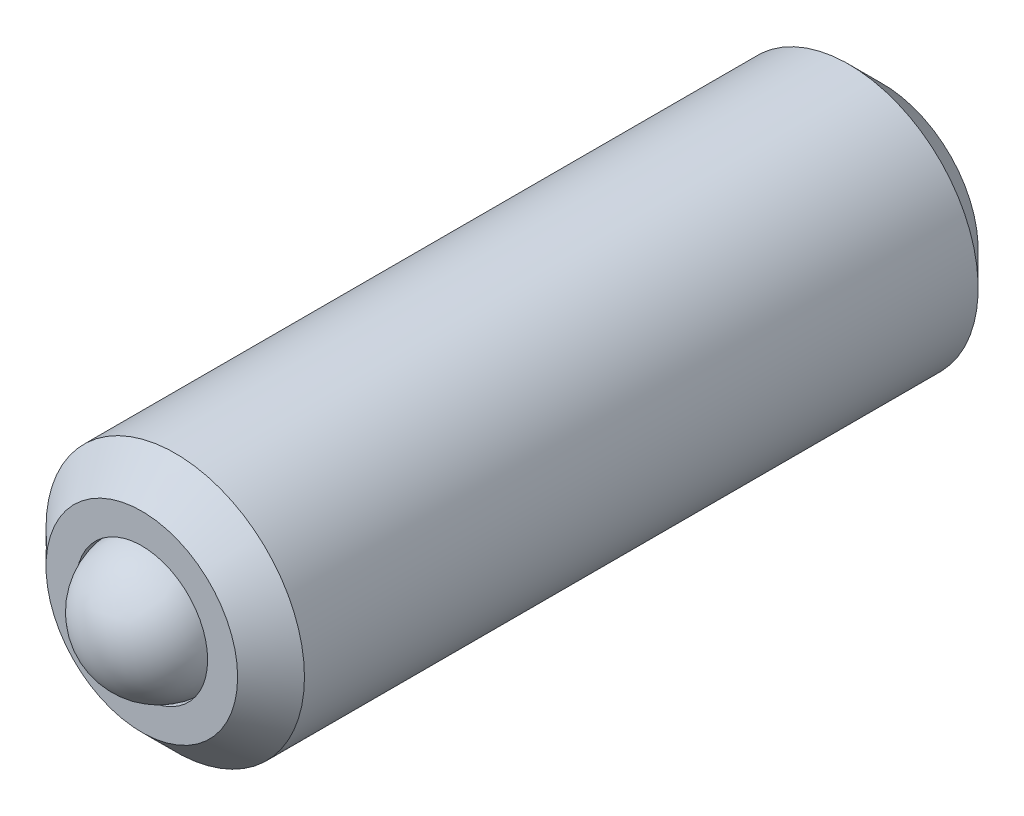
ISO-10303-21;
HEADER;
FILE_DESCRIPTION(('STEP AP214'),'2;1');
FILE_NAME('part.step','',(''),(''),'','','');
FILE_SCHEMA(('AUTOMOTIVE_DESIGN { 1 0 10303 214 1 1 1 1 }'));
ENDSEC;
DATA;
#1=APPLICATION_CONTEXT('core data for automotive mechanical design processes');
#2=APPLICATION_PROTOCOL_DEFINITION('international standard','automotive_design',2000,#1);
#3=PRODUCT_CONTEXT('',#1,'mechanical');
#4=PRODUCT('Part','Part','',(#3));
#5=PRODUCT_RELATED_PRODUCT_CATEGORY('part','',(#4));
#6=PRODUCT_DEFINITION_FORMATION('','',#4);
#7=PRODUCT_DEFINITION_CONTEXT('part definition',#1,'design');
#8=PRODUCT_DEFINITION('design','',#6,#7);
#9=PRODUCT_DEFINITION_SHAPE('','',#8);
#10=(LENGTH_UNIT() NAMED_UNIT(*) SI_UNIT(.MILLI.,.METRE.));
#11=(NAMED_UNIT(*) PLANE_ANGLE_UNIT() SI_UNIT($,.RADIAN.));
#12=(NAMED_UNIT(*) SI_UNIT($,.STERADIAN.) SOLID_ANGLE_UNIT());
#13=UNCERTAINTY_MEASURE_WITH_UNIT(LENGTH_MEASURE(1.E-05),#10,'distance_accuracy_value','');
#14=(GEOMETRIC_REPRESENTATION_CONTEXT(3) GLOBAL_UNCERTAINTY_ASSIGNED_CONTEXT((#13)) GLOBAL_UNIT_ASSIGNED_CONTEXT((#10,
#11,#12)) REPRESENTATION_CONTEXT('',''));
#15=CARTESIAN_POINT('',(0.,0.,0.));
#16=DIRECTION('',(0.,0.,1.));
#17=DIRECTION('',(1.,0.,0.));
#18=AXIS2_PLACEMENT_3D('',#15,#16,#17);
#19=CARTESIAN_POINT('',(-13.8015219006888,9.16371887558397,3.77536408732516));
#20=DIRECTION('',(-0.670867236902941,-0.151569932323345,0.725922658460052));
#21=DIRECTION('',(0.369858427725452,0.780064513114228,0.504682176047777));
#22=AXIS2_PLACEMENT_3D('',#19,#20,#21);
#23=SPHERICAL_SURFACE('',#22,0.5);
#24=CARTESIAN_POINT('',(-14.1369555191403,9.0879339094223,4.13832541655519));
#25=VERTEX_POINT('',#24);
#26=VERTEX_LOOP('',#25);
#27=FACE_BOUND('',#26,.T.);
#28=ADVANCED_FACE('P0_F11',(#27),#23,.T.);
#29=CLOSED_SHELL('',(#28));
#30=MANIFOLD_SOLID_BREP('P0_B1',#29);
#31=CARTESIAN_POINT('',(-13.8015219006888,9.16371887558398,3.90236408732514));
#32=DIRECTION('',(0.,0.,-1.));
#33=DIRECTION('',(-1.,0.,0.));
#34=AXIS2_PLACEMENT_3D('',#31,#32,#33);
#35=CYLINDRICAL_SURFACE('',#34,0.982);
#36=CARTESIAN_POINT('',(-13.8015219006888,9.16371887558398,-1.47063591267486));
#37=DIRECTION('',(0.,0.,-1.));
#38=DIRECTION('',(-1.,0.,0.));
#39=AXIS2_PLACEMENT_3D('',#36,#37,#38);
#40=CIRCLE('',#39,0.982);
#41=CARTESIAN_POINT('',(-14.7835219006888,9.16371887558398,-1.47063591267486));
#42=VERTEX_POINT('',#41);
#43=EDGE_CURVE('P1_E205',#42,#42,#40,.F.);
#44=ORIENTED_EDGE('',*,*,#43,.T.);
#45=EDGE_LOOP('',(#44));
#46=FACE_BOUND('',#45,.T.);
#47=CARTESIAN_POINT('',(-13.8015219006888,9.16371887558398,3.64836408732514));
#48=DIRECTION('',(0.,0.,1.));
#49=DIRECTION('',(1.,0.,0.));
#50=AXIS2_PLACEMENT_3D('',#47,#48,#49);
#51=CIRCLE('',#50,0.982);
#52=CARTESIAN_POINT('',(-12.8195219006888,9.16371887558398,3.64836408732514));
#53=VERTEX_POINT('',#52);
#54=EDGE_CURVE('P1_E209',#53,#53,#51,.F.);
#55=ORIENTED_EDGE('',*,*,#54,.T.);
#56=EDGE_LOOP('',(#55));
#57=FACE_BOUND('',#56,.T.);
#58=ADVANCED_FACE('P1_F15',(#46,#57),#35,.T.);
#59=CARTESIAN_POINT('',(-13.8015219006888,9.16371887558398,3.90236408732514));
#60=DIRECTION('',(0.,0.,1.));
#61=DIRECTION('',(1.,0.,0.));
#62=AXIS2_PLACEMENT_3D('',#59,#60,#61);
#63=PLANE('',#62);
#64=CARTESIAN_POINT('',(-13.8015219006888,9.16371887558398,3.90236408732514));
#65=DIRECTION('',(0.,0.,1.));
#66=DIRECTION('',(1.,0.,0.));
#67=AXIS2_PLACEMENT_3D('',#64,#65,#66);
#68=CIRCLE('',#67,0.728);
#69=CARTESIAN_POINT('',(-13.0735219006888,9.16371887558398,3.90236408732514));
#70=VERTEX_POINT('',#69);
#71=EDGE_CURVE('P1_E29',#70,#70,#68,.T.);
#72=ORIENTED_EDGE('',*,*,#71,.T.);
#73=EDGE_LOOP('',(#72));
#74=FACE_BOUND('',#73,.T.);
#75=CARTESIAN_POINT('',(-13.8015219006888,9.16371887558398,3.90236408732514));
#76=DIRECTION('',(0.,0.,1.));
#77=DIRECTION('',(1.,0.,0.));
#78=AXIS2_PLACEMENT_3D('',#75,#76,#77);
#79=CIRCLE('',#78,0.5);
#80=CARTESIAN_POINT('',(-13.3015219006888,9.16371887558398,3.90236408732514));
#81=VERTEX_POINT('',#80);
#82=EDGE_CURVE('P1_E210',#81,#81,#79,.T.);
#83=ORIENTED_EDGE('',*,*,#82,.F.);
#84=EDGE_LOOP('',(#83));
#85=FACE_BOUND('',#84,.T.);
#86=ADVANCED_FACE('P1_F181',(#74,#85),#63,.T.);
#87=CARTESIAN_POINT('',(-13.8015219006888,9.16371887558398,3.90236408732514));
#88=DIRECTION('',(0.,0.,1.));
#89=DIRECTION('',(1.,0.,0.));
#90=AXIS2_PLACEMENT_3D('',#87,#88,#89);
#91=CYLINDRICAL_SURFACE('',#90,0.5);
#92=CARTESIAN_POINT('',(-13.8015219006888,9.16371887558398,3.56825730613859));
#93=DIRECTION('',(0.,0.,1.));
#94=DIRECTION('',(1.,0.,0.));
#95=AXIS2_PLACEMENT_3D('',#92,#93,#94);
#96=CIRCLE('',#95,0.5);
#97=CARTESIAN_POINT('',(-13.3015219006888,9.16371887558398,3.56825730613859));
#98=VERTEX_POINT('',#97);
#99=EDGE_CURVE('P1_E215',#98,#98,#96,.T.);
#100=ORIENTED_EDGE('',*,*,#99,.F.);
#101=EDGE_LOOP('',(#100));
#102=FACE_BOUND('',#101,.T.);
#103=ORIENTED_EDGE('',*,*,#82,.T.);
#104=EDGE_LOOP('',(#103));
#105=FACE_BOUND('',#104,.T.);
#106=ADVANCED_FACE('P1_F187',(#102,#105),#91,.F.);
#107=CARTESIAN_POINT('',(-13.8015219006888,9.16371887558398,3.56825730613859));
#108=DIRECTION('',(0.,0.,1.));
#109=DIRECTION('',(1.,0.,0.));
#110=AXIS2_PLACEMENT_3D('',#107,#108,#109);
#111=CONICAL_SURFACE('',#110,0.5,0.785398163397443);
#112=CARTESIAN_POINT('',(-13.8015219006888,9.16371887558398,3.06825730613859));
#113=VERTEX_POINT('',#112);
#114=VERTEX_LOOP('',#113);
#115=FACE_BOUND('',#114,.T.);
#116=ORIENTED_EDGE('',*,*,#99,.T.);
#117=EDGE_LOOP('',(#116));
#118=FACE_BOUND('',#117,.T.);
#119=ADVANCED_FACE('P1_F201',(#115,#118),#111,.F.);
#120=CARTESIAN_POINT('',(-13.8015219006888,9.16371887558398,-1.72463591267486));
#121=DIRECTION('',(0.,0.,-1.));
#122=DIRECTION('',(-1.,0.,0.));
#123=AXIS2_PLACEMENT_3D('',#120,#121,#122);
#124=PLANE('',#123);
#125=CARTESIAN_POINT('',(-13.8015219006888,9.16371887558398,-1.72463591267486));
#126=DIRECTION('',(0.,0.,-1.));
#127=DIRECTION('',(-1.,0.,0.));
#128=AXIS2_PLACEMENT_3D('',#125,#126,#127);
#129=CIRCLE('',#128,0.635);
#130=CARTESIAN_POINT('',(-14.351448032092,9.48121887558398,-1.72463591267486));
#131=VERTEX_POINT('',#130);
#132=CARTESIAN_POINT('',(-13.8015219006888,9.79871887558398,-1.72463591267486));
#133=VERTEX_POINT('',#132);
#134=EDGE_CURVE('P1_E35',#131,#133,#129,.T.);
#135=ORIENTED_EDGE('',*,*,#134,.F.);
#136=CARTESIAN_POINT('',(-14.351448032092,8.84621887558398,-1.72463591267486));
#137=VERTEX_POINT('',#136);
#138=EDGE_CURVE('P1_E42',#137,#131,#129,.T.);
#139=ORIENTED_EDGE('',*,*,#138,.F.);
#140=CARTESIAN_POINT('',(-13.8015219006888,8.52871887558398,-1.72463591267486));
#141=VERTEX_POINT('',#140);
#142=EDGE_CURVE('P1_E115',#141,#137,#129,.T.);
#143=ORIENTED_EDGE('',*,*,#142,.F.);
#144=CARTESIAN_POINT('',(-13.2515957692857,8.84621887558398,-1.72463591267486));
#145=VERTEX_POINT('',#144);
#146=EDGE_CURVE('P1_E114',#145,#141,#129,.T.);
#147=ORIENTED_EDGE('',*,*,#146,.F.);
#148=CARTESIAN_POINT('',(-13.2515957692857,9.48121887558398,-1.72463591267486));
#149=VERTEX_POINT('',#148);
#150=EDGE_CURVE('P1_E85',#149,#145,#129,.T.);
#151=ORIENTED_EDGE('',*,*,#150,.F.);
#152=EDGE_CURVE('P1_E77',#133,#149,#129,.T.);
#153=ORIENTED_EDGE('',*,*,#152,.F.);
#154=EDGE_LOOP('',(#135,#139,#143,#147,#151,#153));
#155=FACE_BOUND('',#154,.T.);
#156=CARTESIAN_POINT('',(-13.8015219006888,9.16371887558398,-1.72463591267486));
#157=DIRECTION('',(0.,0.,-1.));
#158=DIRECTION('',(-1.,0.,0.));
#159=AXIS2_PLACEMENT_3D('',#156,#157,#158);
#160=CIRCLE('',#159,0.728);
#161=CARTESIAN_POINT('',(-14.5295219006888,9.16371887558398,-1.72463591267486));
#162=VERTEX_POINT('',#161);
#163=EDGE_CURVE('P1_E208',#162,#162,#160,.T.);
#164=ORIENTED_EDGE('',*,*,#163,.T.);
#165=EDGE_LOOP('',(#164));
#166=FACE_BOUND('',#165,.T.);
#167=ADVANCED_FACE('P1_F111',(#155,#166),#124,.T.);
#168=CARTESIAN_POINT('',(-13.8015219006888,9.16371887558398,-1.72463591267486));
#169=DIRECTION('',(0.,0.,1.));
#170=DIRECTION('',(1.,0.,0.));
#171=AXIS2_PLACEMENT_3D('',#168,#169,#170);
#172=CONICAL_SURFACE('',#171,0.728,0.785398163397445);
#173=ORIENTED_EDGE('',*,*,#43,.F.);
#174=EDGE_LOOP('',(#173));
#175=FACE_BOUND('',#174,.T.);
#176=ORIENTED_EDGE('',*,*,#163,.F.);
#177=EDGE_LOOP('',(#176));
#178=FACE_BOUND('',#177,.T.);
#179=ADVANCED_FACE('P1_F193',(#175,#178),#172,.T.);
#180=CARTESIAN_POINT('',(-13.8015219006888,9.16371887558398,3.90236408732514));
#181=DIRECTION('',(0.,0.,-1.));
#182=DIRECTION('',(-1.,0.,0.));
#183=AXIS2_PLACEMENT_3D('',#180,#181,#182);
#184=CONICAL_SURFACE('',#183,0.728,0.785398163397445);
#185=ORIENTED_EDGE('',*,*,#54,.F.);
#186=EDGE_LOOP('',(#185));
#187=FACE_BOUND('',#186,.T.);
#188=ORIENTED_EDGE('',*,*,#71,.F.);
#189=EDGE_LOOP('',(#188));
#190=FACE_BOUND('',#189,.T.);
#191=ADVANCED_FACE('P1_F17',(#187,#190),#184,.T.);
#192=CARTESIAN_POINT('',(-13.8015219006888,9.16371887558398,-1.72463591267486));
#193=DIRECTION('',(0.,0.,-1.));
#194=DIRECTION('',(-1.,0.,0.));
#195=AXIS2_PLACEMENT_3D('',#192,#193,#194);
#196=CONICAL_SURFACE('',#195,0.635,0.785398163397448);
#197=ORIENTED_EDGE('',*,*,#150,.T.);
#198=CARTESIAN_POINT('',(-13.2515957692857,8.53049428556369,-1.92832067550674));
#199=CARTESIAN_POINT('',(-13.2515957692857,8.56134580341744,-1.90507960896681));
#200=CARTESIAN_POINT('',(-13.2515957692857,8.59252359792126,-1.88222375636953));
#201=CARTESIAN_POINT('',(-13.2515957692857,8.65606837176296,-1.83769171355886));
#202=CARTESIAN_POINT('',(-13.2515957692857,8.68844272801976,-1.81602611118458));
#203=CARTESIAN_POINT('',(-13.2515957692857,8.75632896158876,-1.77348415360168));
#204=CARTESIAN_POINT('',(-13.2515957692857,8.79191444951981,-1.75272343402482));
#205=CARTESIAN_POINT('',(-13.2515957692857,8.86486133380717,-1.71474964501993));
#206=CARTESIAN_POINT('',(-13.2515957692857,8.90221619897699,-1.69752461573685));
#207=CARTESIAN_POINT('',(-13.2515957692857,8.95829180543014,-1.67645284792743));
#208=CARTESIAN_POINT('',(-13.2515957692857,8.97617938610514,-1.67040535114631));
#209=CARTESIAN_POINT('',(-13.2515957692857,9.01237679713688,-1.65974253899439));
#210=CARTESIAN_POINT('',(-13.2515957692857,9.03068665648945,-1.65512732228778));
#211=CARTESIAN_POINT('',(-13.2515957692857,9.08548280887646,-1.64397508728981));
#212=CARTESIAN_POINT('',(-13.2515957692857,9.12251788508019,-1.63985723572798));
#213=CARTESIAN_POINT('',(-13.2515957692857,9.19530422872083,-1.63930809595227));
#214=CARTESIAN_POINT('',(-13.2515957692857,9.23105347396853,-1.64260414174546));
#215=CARTESIAN_POINT('',(-13.2515957692857,9.28405165642866,-1.65229298252524));
#216=CARTESIAN_POINT('',(-13.2515957692857,9.30177136424451,-1.65637279027604));
#217=CARTESIAN_POINT('',(-13.2515957692857,9.33683157146912,-1.66592080719211));
#218=CARTESIAN_POINT('',(-13.2515957692857,9.35417210247592,-1.67138890018445));
#219=CARTESIAN_POINT('',(-13.2515957692857,9.40876472001817,-1.69066240023304));
#220=CARTESIAN_POINT('',(-13.2515957692857,9.44523723570716,-1.70666368801341));
#221=CARTESIAN_POINT('',(-13.2515957692857,9.51647012616568,-1.74224309375108));
#222=CARTESIAN_POINT('',(-13.2515957692857,9.55122376094072,-1.76183406231197));
#223=CARTESIAN_POINT('',(-13.2515957692857,9.61764417640121,-1.80224033739483));
#224=CARTESIAN_POINT('',(-13.2515957692857,9.64937853174813,-1.82294642547188));
#225=CARTESIAN_POINT('',(-13.2515957692857,9.71162270972014,-1.86560605496745));
#226=CARTESIAN_POINT('',(-13.2515957692857,9.74214042301385,-1.88754801254038));
#227=CARTESIAN_POINT('',(-13.2515957692857,9.77232314429079,-1.90989069375702));
#228=B_SPLINE_CURVE_WITH_KNOTS('',3,(#198,#199,#200,#201,#202,#203,#204,#205,#206,#207,#208,
#209,#210,#211,#212,#213,#214,#215,#216,#217,#218,#219,#220,#221,#222,#223,#224,#225,#226,#227),
.UNSPECIFIED.,.F.,.F.,(4,2,2,2,2,2,2,2,2,2,2,2,2,2,4),(0.,0.115919377669941,0.232742618789014,
0.356233992025996,0.479300496450954,0.535894602508555,0.592492606248892,0.70351197570278,
0.810515319981284,0.865016025394726,0.919512171643781,1.03864987361044,1.15822271572585,
1.27185363992294,1.38455547987616),.UNSPECIFIED.);
#229=EDGE_CURVE('P1_E10',#149,#145,#228,.F.);
#230=ORIENTED_EDGE('',*,*,#229,.F.);
#231=EDGE_LOOP('',(#197,#230));
#232=FACE_BOUND('',#231,.T.);
#233=ADVANCED_FACE('P1_F89',(#232),#196,.F.);
#234=ORIENTED_EDGE('',*,*,#146,.T.);
#235=CARTESIAN_POINT('',(-13.2513957692857,8.84633434563782,-1.72475141421904));
#236=CARTESIAN_POINT('',(-13.270309905032,8.83541426427321,-1.71383709331536));
#237=CARTESIAN_POINT('',(-13.2895391300036,8.82431226605955,-1.7035623497835));
#238=CARTESIAN_POINT('',(-13.3287502096868,8.80167373864922,-1.6847486979151));
#239=CARTESIAN_POINT('',(-13.3487358020015,8.79013505154644,-1.67622027049874));
#240=CARTESIAN_POINT('',(-13.3890384532812,8.76686630498107,-1.66161247496098));
#241=CARTESIAN_POINT('',(-13.4093451856095,8.75514220760494,-1.65549631440276));
#242=CARTESIAN_POINT('',(-13.450396132564,8.73144143233025,-1.64606523328979));
#243=CARTESIAN_POINT('',(-13.4711391145704,8.71946546608507,-1.64274328624867));
#244=CARTESIAN_POINT('',(-13.5218024501745,8.69021497563602,-1.63852890046083));
#245=CARTESIAN_POINT('',(-13.5518411285175,8.67287213660859,-1.63929083524874));
#246=CARTESIAN_POINT('',(-13.6112889024359,8.63854994833406,-1.64714490109844));
#247=CARTESIAN_POINT('',(-13.6406969903653,8.62157118085169,-1.65424648779059));
#248=CARTESIAN_POINT('',(-13.6923494746535,8.59174960514357,-1.67137450463772));
#249=CARTESIAN_POINT('',(-13.714831090689,8.57876983807368,-1.68050833413818));
#250=CARTESIAN_POINT('',(-13.7589132342437,8.55331900062587,-1.70108513193827));
#251=CARTESIAN_POINT('',(-13.7805163596048,8.54084643038333,-1.71252058992845));
#252=CARTESIAN_POINT('',(-13.8017219006888,8.52860340553014,-1.72475141421904));
#253=B_SPLINE_CURVE_WITH_KNOTS('',3,(#235,#236,#237,#238,#239,#240,#241,#242,#243,#244,#245,
#246,#247,#248,#249,#250,#251,#252),.UNSPECIFIED.,.F.,.F.,(4,2,2,2,2,2,2,2,4),(0.,
0.0732955286089271,0.147018835182714,0.219569654599973,0.291937483545067,0.395361253462808,
0.498939538783553,0.581380863799342,0.663557417834381),.UNSPECIFIED.);
#254=EDGE_CURVE('P1_E117',#145,#141,#253,.T.);
#255=ORIENTED_EDGE('',*,*,#254,.F.);
#256=EDGE_LOOP('',(#234,#255));
#257=FACE_BOUND('',#256,.T.);
#258=ADVANCED_FACE('P1_F278',(#257),#196,.F.);
#259=ORIENTED_EDGE('',*,*,#142,.T.);
#260=CARTESIAN_POINT('',(-13.8013219006888,8.52860340553014,-1.72475141421904));
#261=CARTESIAN_POINT('',(-13.8202360364351,8.53952348689475,-1.71383709331536));
#262=CARTESIAN_POINT('',(-13.8394652614067,8.55062548510841,-1.7035623497835));
#263=CARTESIAN_POINT('',(-13.87867634109,8.57326401251874,-1.6847486979151));
#264=CARTESIAN_POINT('',(-13.8986619334046,8.58480269962152,-1.67622027049874));
#265=CARTESIAN_POINT('',(-13.9389645846843,8.60807144618689,-1.66161247496098));
#266=CARTESIAN_POINT('',(-13.9592713170126,8.61979554356303,-1.65549631440276));
#267=CARTESIAN_POINT('',(-14.0003222639672,8.64349631883771,-1.64606523328979));
#268=CARTESIAN_POINT('',(-14.0210652459735,8.6554722850829,-1.64274328624867));
#269=CARTESIAN_POINT('',(-14.0717285815776,8.68472277553194,-1.63852890046083));
#270=CARTESIAN_POINT('',(-14.1017672599206,8.70206561455937,-1.63929083524874));
#271=CARTESIAN_POINT('',(-14.161215033839,8.7363878028339,-1.64714490109844));
#272=CARTESIAN_POINT('',(-14.1906231217684,8.75336657031628,-1.65424648779059));
#273=CARTESIAN_POINT('',(-14.2422756060566,8.7831881460244,-1.67137450463772));
#274=CARTESIAN_POINT('',(-14.2647572220921,8.79616791309428,-1.68050833413818));
#275=CARTESIAN_POINT('',(-14.3088393656469,8.82161875054209,-1.70108513193827));
#276=CARTESIAN_POINT('',(-14.3304424910079,8.83409132078463,-1.71252058992844));
#277=CARTESIAN_POINT('',(-14.351648032092,8.84633434563782,-1.72475141421904));
#278=B_SPLINE_CURVE_WITH_KNOTS('',3,(#260,#261,#262,#263,#264,#265,#266,#267,#268,#269,#270,
#271,#272,#273,#274,#275,#276,#277),.UNSPECIFIED.,.F.,.F.,(4,2,2,2,2,2,2,2,4),(0.,
0.0732955286089271,0.147018835182714,0.219569654599973,0.291937483545067,0.395361253462808,
0.498939538783554,0.581380863799342,0.663557417834381),.UNSPECIFIED.);
#279=EDGE_CURVE('P1_E125',#141,#137,#278,.T.);
#280=ORIENTED_EDGE('',*,*,#279,.F.);
#281=EDGE_LOOP('',(#259,#280));
#282=FACE_BOUND('',#281,.T.);
#283=ADVANCED_FACE('P1_F275',(#282),#196,.F.);
#284=ORIENTED_EDGE('',*,*,#138,.T.);
#285=CARTESIAN_POINT('',(-14.351448032092,8.53049428565582,-1.92832067543718));
#286=CARTESIAN_POINT('',(-14.351448032092,8.56134580350439,-1.9050796089026));
#287=CARTESIAN_POINT('',(-14.351448032092,8.59252359800301,-1.88222375631066));
#288=CARTESIAN_POINT('',(-14.351448032092,8.65606837183406,-1.83769171351068));
#289=CARTESIAN_POINT('',(-14.351448032092,8.68844272808541,-1.81602611114173));
#290=CARTESIAN_POINT('',(-14.351448032092,8.75632896164251,-1.77348415356979));
#291=CARTESIAN_POINT('',(-14.351448032092,8.7919144495671,-1.75272343399853));
#292=CARTESIAN_POINT('',(-14.351448032092,8.86486133384097,-1.71474964500401));
#293=CARTESIAN_POINT('',(-14.351448032092,8.90221619900378,-1.69752461572571));
#294=CARTESIAN_POINT('',(-14.351448032092,8.95829180545165,-1.67645284791983));
#295=CARTESIAN_POINT('',(-14.351448032092,8.97617938612887,-1.67040535113858));
#296=CARTESIAN_POINT('',(-14.351448032092,9.01237679716509,-1.65974253898683));
#297=CARTESIAN_POINT('',(-14.351448032092,9.03068665651995,-1.65512732228052));
#298=CARTESIAN_POINT('',(-14.351448032092,9.08548280891364,-1.64397508728427));
#299=CARTESIAN_POINT('',(-14.351448032092,9.12251788512181,-1.6398572357246));
#300=CARTESIAN_POINT('',(-14.351448032092,9.19530422877031,-1.63930809595486));
#301=CARTESIAN_POINT('',(-14.351448032092,9.23105347402146,-1.64260414175176));
#302=CARTESIAN_POINT('',(-14.351448032092,9.28405165648634,-1.65229298253754));
#303=CARTESIAN_POINT('',(-14.351448032092,9.30177136430376,-1.65637279029045));
#304=CARTESIAN_POINT('',(-14.351448032092,9.33683157153138,-1.66592080721078));
#305=CARTESIAN_POINT('',(-14.351448032092,9.35417210253962,-1.67138890020529));
#306=CARTESIAN_POINT('',(-14.351448032092,9.40876472009573,-1.69066240026405));
#307=CARTESIAN_POINT('',(-14.351448032092,9.44523723579647,-1.70666368805379));
#308=CARTESIAN_POINT('',(-14.351448032092,9.51647012627758,-1.74224309381122));
#309=CARTESIAN_POINT('',(-14.351448032092,9.55122376106346,-1.76183406238251));
#310=CARTESIAN_POINT('',(-14.351448032092,9.61764417654344,-1.80224033748529));
#311=CARTESIAN_POINT('',(-14.351448032092,9.64937853189908,-1.82294642557174));
#312=CARTESIAN_POINT('',(-14.351448032092,9.71162270988823,-1.86560605508606));
#313=CARTESIAN_POINT('',(-14.351448032092,9.74214042319035,-1.88754801266831));
#314=CARTESIAN_POINT('',(-14.351448032092,9.7723231444757,-1.90989069389423));
#315=B_SPLINE_CURVE_WITH_KNOTS('',3,(#285,#286,#287,#288,#289,#290,#291,#292,#293,#294,#295,
#296,#297,#298,#299,#300,#301,#302,#303,#304,#305,#306,#307,#308,#309,#310,#311,#312,#313,#314),
.UNSPECIFIED.,.F.,.F.,(4,2,2,2,2,2,2,2,2,2,2,2,2,2,4),(0.,0.115919377647874,0.232742618744465,
0.356233991956237,0.479300496356226,0.535894602420219,0.592492606166936,0.703511975633009,
0.810515319922693,0.865016025342174,0.919512171597262,1.03864987360729,1.15822271576635,
1.27185364000079,1.38455547999086),.UNSPECIFIED.);
#316=EDGE_CURVE('P1_E145',#137,#131,#315,.T.);
#317=ORIENTED_EDGE('',*,*,#316,.F.);
#318=EDGE_LOOP('',(#284,#317));
#319=FACE_BOUND('',#318,.T.);
#320=ADVANCED_FACE('P1_F277',(#319),#196,.F.);
#321=ORIENTED_EDGE('',*,*,#134,.T.);
#322=CARTESIAN_POINT('',(-14.351648032092,9.48110340553014,-1.72475141421904));
#323=CARTESIAN_POINT('',(-14.3327338963457,9.49202348689475,-1.71383709331536));
#324=CARTESIAN_POINT('',(-14.3135046713741,9.50312548510841,-1.7035623497835));
#325=CARTESIAN_POINT('',(-14.2742935916908,9.52576401251874,-1.6847486979151));
#326=CARTESIAN_POINT('',(-14.2543079993762,9.53730269962152,-1.67622027049874));
#327=CARTESIAN_POINT('',(-14.2140053480965,9.56057144618689,-1.66161247496098));
#328=CARTESIAN_POINT('',(-14.1936986157682,9.57229554356303,-1.65549631440276));
#329=CARTESIAN_POINT('',(-14.1526476688136,9.59599631883771,-1.64606523328979));
#330=CARTESIAN_POINT('',(-14.1319046868073,9.6079722850829,-1.64274328624867));
#331=CARTESIAN_POINT('',(-14.0812413512032,9.63722277553195,-1.63852890046083));
#332=CARTESIAN_POINT('',(-14.0512026728602,9.65456561455937,-1.63929083524874));
#333=CARTESIAN_POINT('',(-13.9917548989418,9.6888878028339,-1.64714490109844));
#334=CARTESIAN_POINT('',(-13.9623468110124,9.70586657031628,-1.65424648779059));
#335=CARTESIAN_POINT('',(-13.9106943267242,9.7356881460244,-1.67137450463772));
#336=CARTESIAN_POINT('',(-13.8882127106887,9.74866791309428,-1.68050833413818));
#337=CARTESIAN_POINT('',(-13.8441305671339,9.77411875054209,-1.70108513193827));
#338=CARTESIAN_POINT('',(-13.8225274417729,9.78659132078463,-1.71252058992845));
#339=CARTESIAN_POINT('',(-13.8013219006888,9.79883434563782,-1.72475141421904));
#340=B_SPLINE_CURVE_WITH_KNOTS('',3,(#322,#323,#324,#325,#326,#327,#328,#329,#330,#331,#332,
#333,#334,#335,#336,#337,#338,#339),.UNSPECIFIED.,.F.,.F.,(4,2,2,2,2,2,2,2,4),(0.,
0.073295528608927,0.147018835182714,0.219569654599973,0.291937483545065,0.395361253462808,
0.498939538783553,0.581380863799342,0.663557417834381),.UNSPECIFIED.);
#341=EDGE_CURVE('P1_E101',#131,#133,#340,.T.);
#342=ORIENTED_EDGE('',*,*,#341,.F.);
#343=EDGE_LOOP('',(#321,#342));
#344=FACE_BOUND('',#343,.T.);
#345=ADVANCED_FACE('P1_F138',(#344),#196,.F.);
#346=ORIENTED_EDGE('',*,*,#152,.T.);
#347=CARTESIAN_POINT('',(-13.8017219006888,9.79883434563782,-1.72475141421904));
#348=CARTESIAN_POINT('',(-13.7828077649426,9.78791426427321,-1.71383709331536));
#349=CARTESIAN_POINT('',(-13.763578539971,9.77681226605955,-1.7035623497835));
#350=CARTESIAN_POINT('',(-13.7243674602877,9.75417373864922,-1.6847486979151));
#351=CARTESIAN_POINT('',(-13.7043818679731,9.74263505154644,-1.67622027049874));
#352=CARTESIAN_POINT('',(-13.6640792166934,9.71936630498107,-1.66161247496098));
#353=CARTESIAN_POINT('',(-13.6437724843651,9.70764220760494,-1.65549631440276));
#354=CARTESIAN_POINT('',(-13.6027215374105,9.68394143233025,-1.64606523328979));
#355=CARTESIAN_POINT('',(-13.5819785554041,9.67196546608507,-1.64274328624867));
#356=CARTESIAN_POINT('',(-13.5313152198001,9.64271497563602,-1.63852890046083));
#357=CARTESIAN_POINT('',(-13.5012765414571,9.6253721366086,-1.63929083524874));
#358=CARTESIAN_POINT('',(-13.4418287675387,9.59104994833406,-1.64714490109844));
#359=CARTESIAN_POINT('',(-13.4124206796093,9.57407118085169,-1.65424648779059));
#360=CARTESIAN_POINT('',(-13.3607681953211,9.54424960514357,-1.67137450463772));
#361=CARTESIAN_POINT('',(-13.3382865792856,9.53126983807368,-1.68050833413818));
#362=CARTESIAN_POINT('',(-13.2942044357308,9.50581900062587,-1.70108513193827));
#363=CARTESIAN_POINT('',(-13.2726013103698,9.49334643038334,-1.71252058992845));
#364=CARTESIAN_POINT('',(-13.2513957692857,9.48110340553014,-1.72475141421904));
#365=B_SPLINE_CURVE_WITH_KNOTS('',3,(#347,#348,#349,#350,#351,#352,#353,#354,#355,#356,#357,
#358,#359,#360,#361,#362,#363,#364),.UNSPECIFIED.,.F.,.F.,(4,2,2,2,2,2,2,2,4),(0.,
0.0732955286089271,0.147018835182714,0.219569654599973,0.291937483545066,0.395361253462808,
0.498939538783553,0.581380863799342,0.663557417834381),.UNSPECIFIED.);
#366=EDGE_CURVE('P1_E81',#133,#149,#365,.T.);
#367=ORIENTED_EDGE('',*,*,#366,.F.);
#368=EDGE_LOOP('',(#346,#367));
#369=FACE_BOUND('',#368,.T.);
#370=ADVANCED_FACE('P1_F79',(#369),#196,.F.);
#371=CARTESIAN_POINT('',(-13.8015219006888,9.16371887558398,0.307364087325137));
#372=DIRECTION('',(0.,0.,1.));
#373=DIRECTION('',(1.,0.,0.));
#374=AXIS2_PLACEMENT_3D('',#371,#372,#373);
#375=PLANE('',#374);
#376=DIRECTION('',(0.866025403784439,-0.5,0.));
#377=VECTOR('',#376,1.);
#378=CARTESIAN_POINT('',(-13.2515957692857,9.48121887558398,0.307364087325137));
#379=LINE('',#378,#377);
#380=CARTESIAN_POINT('',(-13.8015219006888,9.79871887558398,0.307364087325137));
#381=VERTEX_POINT('',#380);
#382=CARTESIAN_POINT('',(-13.2515957692857,9.48121887558398,0.307364087325137));
#383=VERTEX_POINT('',#382);
#384=EDGE_CURVE('P1_E100',#381,#383,#379,.T.);
#385=ORIENTED_EDGE('',*,*,#384,.T.);
#386=DIRECTION('',(0.,-1.,0.));
#387=VECTOR('',#386,1.);
#388=CARTESIAN_POINT('',(-13.2515957692857,8.84621887558398,0.307364087325137));
#389=LINE('',#388,#387);
#390=CARTESIAN_POINT('',(-13.2515957692857,8.84621887558398,0.307364087325137));
#391=VERTEX_POINT('',#390);
#392=EDGE_CURVE('P1_E105',#383,#391,#389,.T.);
#393=ORIENTED_EDGE('',*,*,#392,.T.);
#394=DIRECTION('',(-0.866025403784439,-0.5,0.));
#395=VECTOR('',#394,1.);
#396=CARTESIAN_POINT('',(-13.8015219006888,8.52871887558398,0.307364087325137));
#397=LINE('',#396,#395);
#398=CARTESIAN_POINT('',(-13.8015219006888,8.52871887558398,0.307364087325137));
#399=VERTEX_POINT('',#398);
#400=EDGE_CURVE('P1_E247',#391,#399,#397,.T.);
#401=ORIENTED_EDGE('',*,*,#400,.T.);
#402=DIRECTION('',(-0.866025403784439,0.5,0.));
#403=VECTOR('',#402,1.);
#404=CARTESIAN_POINT('',(-14.351448032092,8.84621887558398,0.307364087325137));
#405=LINE('',#404,#403);
#406=CARTESIAN_POINT('',(-14.351448032092,8.84621887558398,0.307364087325137));
#407=VERTEX_POINT('',#406);
#408=EDGE_CURVE('P1_E251',#399,#407,#405,.T.);
#409=ORIENTED_EDGE('',*,*,#408,.T.);
#410=DIRECTION('',(0.,1.,0.));
#411=VECTOR('',#410,1.);
#412=CARTESIAN_POINT('',(-14.351448032092,9.48121887558398,0.307364087325137));
#413=LINE('',#412,#411);
#414=CARTESIAN_POINT('',(-14.351448032092,9.48121887558398,0.307364087325137));
#415=VERTEX_POINT('',#414);
#416=EDGE_CURVE('P1_E254',#407,#415,#413,.T.);
#417=ORIENTED_EDGE('',*,*,#416,.T.);
#418=DIRECTION('',(0.866025403784439,0.5,0.));
#419=VECTOR('',#418,1.);
#420=CARTESIAN_POINT('',(-13.8015219006888,9.79871887558398,0.307364087325137));
#421=LINE('',#420,#419);
#422=EDGE_CURVE('P1_E108',#415,#381,#421,.T.);
#423=ORIENTED_EDGE('',*,*,#422,.T.);
#424=EDGE_LOOP('',(#385,#393,#401,#409,#417,#423));
#425=FACE_BOUND('',#424,.T.);
#426=ADVANCED_FACE('P1_F137',(#425),#375,.F.);
#427=CARTESIAN_POINT('',(-13.2515957692857,8.84621887558398,0.307364087325137));
#428=DIRECTION('',(1.,0.,0.));
#429=DIRECTION('',(0.,1.,0.));
#430=AXIS2_PLACEMENT_3D('',#427,#428,#429);
#431=PLANE('',#430);
#432=DIRECTION('',(0.,0.,-1.));
#433=VECTOR('',#432,1.);
#434=CARTESIAN_POINT('',(-13.2515957692857,9.48121887558398,0.307364087325137));
#435=LINE('',#434,#433);
#436=EDGE_CURVE('P1_E97',#383,#149,#435,.T.);
#437=ORIENTED_EDGE('',*,*,#436,.T.);
#438=ORIENTED_EDGE('',*,*,#229,.T.);
#439=DIRECTION('',(0.,0.,-1.));
#440=VECTOR('',#439,1.);
#441=CARTESIAN_POINT('',(-13.2515957692857,8.84621887558398,0.307364087325137));
#442=LINE('',#441,#440);
#443=EDGE_CURVE('P1_E107',#391,#145,#442,.T.);
#444=ORIENTED_EDGE('',*,*,#443,.F.);
#445=ORIENTED_EDGE('',*,*,#392,.F.);
#446=EDGE_LOOP('',(#437,#438,#444,#445));
#447=FACE_BOUND('',#446,.T.);
#448=ADVANCED_FACE('P1_F103',(#447),#431,.F.);
#449=CARTESIAN_POINT('',(-13.8015219006888,8.52871887558398,0.307364087325137));
#450=DIRECTION('',(0.5,-0.866025403784439,0.));
#451=DIRECTION('',(0.866025403784439,0.5,0.));
#452=AXIS2_PLACEMENT_3D('',#449,#450,#451);
#453=PLANE('',#452);
#454=ORIENTED_EDGE('',*,*,#443,.T.);
#455=ORIENTED_EDGE('',*,*,#254,.T.);
#456=DIRECTION('',(0.,0.,-1.));
#457=VECTOR('',#456,1.);
#458=CARTESIAN_POINT('',(-13.8015219006888,8.52871887558398,0.307364087325137));
#459=LINE('',#458,#457);
#460=EDGE_CURVE('P1_E263',#399,#141,#459,.T.);
#461=ORIENTED_EDGE('',*,*,#460,.F.);
#462=ORIENTED_EDGE('',*,*,#400,.F.);
#463=EDGE_LOOP('',(#454,#455,#461,#462));
#464=FACE_BOUND('',#463,.T.);
#465=ADVANCED_FACE('P1_F132',(#464),#453,.F.);
#466=CARTESIAN_POINT('',(-14.351448032092,8.84621887558398,0.307364087325137));
#467=DIRECTION('',(-0.5,-0.866025403784439,0.));
#468=DIRECTION('',(0.866025403784439,-0.5,0.));
#469=AXIS2_PLACEMENT_3D('',#466,#467,#468);
#470=PLANE('',#469);
#471=ORIENTED_EDGE('',*,*,#460,.T.);
#472=ORIENTED_EDGE('',*,*,#279,.T.);
#473=DIRECTION('',(0.,0.,-1.));
#474=VECTOR('',#473,1.);
#475=CARTESIAN_POINT('',(-14.351448032092,8.84621887558398,0.307364087325137));
#476=LINE('',#475,#474);
#477=EDGE_CURVE('P1_E261',#407,#137,#476,.T.);
#478=ORIENTED_EDGE('',*,*,#477,.F.);
#479=ORIENTED_EDGE('',*,*,#408,.F.);
#480=EDGE_LOOP('',(#471,#472,#478,#479));
#481=FACE_BOUND('',#480,.T.);
#482=ADVANCED_FACE('P1_F169',(#481),#470,.F.);
#483=CARTESIAN_POINT('',(-14.351448032092,9.48121887558398,0.307364087325137));
#484=DIRECTION('',(-1.,0.,0.));
#485=DIRECTION('',(0.,-1.,0.));
#486=AXIS2_PLACEMENT_3D('',#483,#484,#485);
#487=PLANE('',#486);
#488=ORIENTED_EDGE('',*,*,#477,.T.);
#489=ORIENTED_EDGE('',*,*,#316,.T.);
#490=DIRECTION('',(0.,0.,-1.));
#491=VECTOR('',#490,1.);
#492=CARTESIAN_POINT('',(-14.351448032092,9.48121887558398,0.307364087325137));
#493=LINE('',#492,#491);
#494=EDGE_CURVE('P1_E258',#415,#131,#493,.T.);
#495=ORIENTED_EDGE('',*,*,#494,.F.);
#496=ORIENTED_EDGE('',*,*,#416,.F.);
#497=EDGE_LOOP('',(#488,#489,#495,#496));
#498=FACE_BOUND('',#497,.T.);
#499=ADVANCED_FACE('P1_F165',(#498),#487,.F.);
#500=CARTESIAN_POINT('',(-13.8015219006888,9.79871887558398,0.307364087325137));
#501=DIRECTION('',(-0.5,0.866025403784439,0.));
#502=DIRECTION('',(-0.866025403784439,-0.5,0.));
#503=AXIS2_PLACEMENT_3D('',#500,#501,#502);
#504=PLANE('',#503);
#505=ORIENTED_EDGE('',*,*,#494,.T.);
#506=ORIENTED_EDGE('',*,*,#341,.T.);
#507=DIRECTION('',(0.,0.,-1.));
#508=VECTOR('',#507,1.);
#509=CARTESIAN_POINT('',(-13.8015219006888,9.79871887558398,0.307364087325137));
#510=LINE('',#509,#508);
#511=EDGE_CURVE('P1_E99',#381,#133,#510,.T.);
#512=ORIENTED_EDGE('',*,*,#511,.F.);
#513=ORIENTED_EDGE('',*,*,#422,.F.);
#514=EDGE_LOOP('',(#505,#506,#512,#513));
#515=FACE_BOUND('',#514,.T.);
#516=ADVANCED_FACE('P1_F162',(#515),#504,.F.);
#517=CARTESIAN_POINT('',(-13.2515957692857,9.48121887558398,0.307364087325137));
#518=DIRECTION('',(0.5,0.866025403784439,0.));
#519=DIRECTION('',(-0.866025403784439,0.5,0.));
#520=AXIS2_PLACEMENT_3D('',#517,#518,#519);
#521=PLANE('',#520);
#522=ORIENTED_EDGE('',*,*,#511,.T.);
#523=ORIENTED_EDGE('',*,*,#366,.T.);
#524=ORIENTED_EDGE('',*,*,#436,.F.);
#525=ORIENTED_EDGE('',*,*,#384,.F.);
#526=EDGE_LOOP('',(#522,#523,#524,#525));
#527=FACE_BOUND('',#526,.T.);
#528=ADVANCED_FACE('P1_F95',(#527),#521,.F.);
#529=CLOSED_SHELL('',(#58,#86,#106,#119,#167,#179,#191,#233,#258,#283,#320,#345,#370,#426,#448,
#465,#482,#499,#516,#528));
#530=MANIFOLD_SOLID_BREP('P1_B1',#529);
#531=ADVANCED_BREP_SHAPE_REPRESENTATION('',(#18,#30,#530),#14);
#532=SHAPE_DEFINITION_REPRESENTATION(#9,#531);
ENDSEC;
END-ISO-10303-21;
